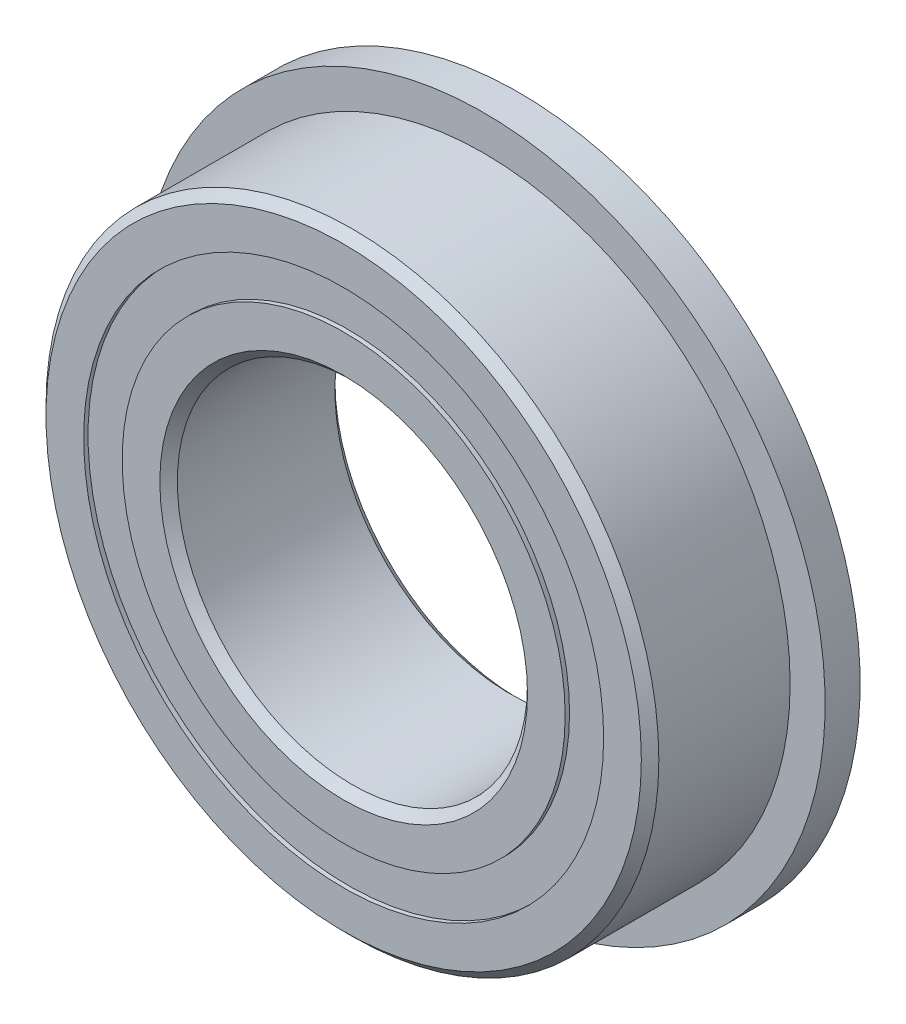
ISO-10303-21;
HEADER;
FILE_DESCRIPTION(('STEP AP214'),'2;1');
FILE_NAME('part.step','',(''),(''),'','','');
FILE_SCHEMA(('AUTOMOTIVE_DESIGN { 1 0 10303 214 1 1 1 1 }'));
ENDSEC;
DATA;
#1=APPLICATION_CONTEXT('core data for automotive mechanical design processes');
#2=APPLICATION_PROTOCOL_DEFINITION('international standard','automotive_design',2000,#1);
#3=PRODUCT_CONTEXT('',#1,'mechanical');
#4=PRODUCT('Part','Part','',(#3));
#5=PRODUCT_RELATED_PRODUCT_CATEGORY('part','',(#4));
#6=PRODUCT_DEFINITION_FORMATION('','',#4);
#7=PRODUCT_DEFINITION_CONTEXT('part definition',#1,'design');
#8=PRODUCT_DEFINITION('design','',#6,#7);
#9=PRODUCT_DEFINITION_SHAPE('','',#8);
#10=(LENGTH_UNIT() NAMED_UNIT(*) SI_UNIT(.MILLI.,.METRE.));
#11=(NAMED_UNIT(*) PLANE_ANGLE_UNIT() SI_UNIT($,.RADIAN.));
#12=(NAMED_UNIT(*) SI_UNIT($,.STERADIAN.) SOLID_ANGLE_UNIT());
#13=UNCERTAINTY_MEASURE_WITH_UNIT(LENGTH_MEASURE(1.E-05),#10,'distance_accuracy_value','');
#14=(GEOMETRIC_REPRESENTATION_CONTEXT(3) GLOBAL_UNCERTAINTY_ASSIGNED_CONTEXT((#13)) GLOBAL_UNIT_ASSIGNED_CONTEXT((#10,
#11,#12)) REPRESENTATION_CONTEXT('',''));
#15=CARTESIAN_POINT('',(0.,0.,0.));
#16=DIRECTION('',(0.,0.,1.));
#17=DIRECTION('',(1.,0.,0.));
#18=AXIS2_PLACEMENT_3D('',#15,#16,#17);
#19=CARTESIAN_POINT('',(0.,5.93956043956044,-1.9));
#20=DIRECTION('',(0.,0.,1.));
#21=DIRECTION('',(1.,0.,0.));
#22=AXIS2_PLACEMENT_3D('',#19,#20,#21);
#23=PLANE('',#22);
#24=CARTESIAN_POINT('',(0.,0.,-1.9));
#25=DIRECTION('',(0.,0.,1.));
#26=DIRECTION('',(1.,0.,0.));
#27=AXIS2_PLACEMENT_3D('',#24,#25,#26);
#28=CIRCLE('',#27,5.93956043956044);
#29=CARTESIAN_POINT('',(5.93956043956044,0.,-1.9));
#30=VERTEX_POINT('',#29);
#31=EDGE_CURVE('E56',#30,#30,#28,.T.);
#32=ORIENTED_EDGE('',*,*,#31,.F.);
#33=EDGE_LOOP('',(#32));
#34=FACE_BOUND('',#33,.T.);
#35=CARTESIAN_POINT('',(0.,0.,-1.9));
#36=DIRECTION('',(0.,0.,1.));
#37=DIRECTION('',(1.,0.,0.));
#38=AXIS2_PLACEMENT_3D('',#35,#36,#37);
#39=CIRCLE('',#38,5.06043956043956);
#40=CARTESIAN_POINT('',(5.06043956043956,0.,-1.9));
#41=VERTEX_POINT('',#40);
#42=EDGE_CURVE('E11',#41,#41,#39,.T.);
#43=ORIENTED_EDGE('',*,*,#42,.T.);
#44=EDGE_LOOP('',(#43));
#45=FACE_BOUND('',#44,.T.);
#46=ADVANCED_FACE('F42',(#34,#45),#23,.F.);
#47=CARTESIAN_POINT('',(0.,0.,2.));
#48=DIRECTION('',(0.,0.,1.));
#49=DIRECTION('',(1.,0.,0.));
#50=AXIS2_PLACEMENT_3D('',#47,#48,#49);
#51=CYLINDRICAL_SURFACE('',#50,5.06043956043956);
#52=ORIENTED_EDGE('',*,*,#42,.F.);
#53=EDGE_LOOP('',(#52));
#54=FACE_BOUND('',#53,.T.);
#55=CARTESIAN_POINT('',(0.,0.,-0.991633418565898));
#56=DIRECTION('',(0.,0.,1.));
#57=DIRECTION('',(1.,0.,0.));
#58=AXIS2_PLACEMENT_3D('',#55,#56,#57);
#59=CIRCLE('',#58,5.06043956043956);
#60=CARTESIAN_POINT('',(5.06043956043956,0.,-0.991633418565898));
#61=VERTEX_POINT('',#60);
#62=EDGE_CURVE('E48',#61,#61,#59,.T.);
#63=ORIENTED_EDGE('',*,*,#62,.T.);
#64=EDGE_LOOP('',(#63));
#65=FACE_BOUND('',#64,.T.);
#66=ADVANCED_FACE('F65',(#54,#65),#51,.F.);
#67=CARTESIAN_POINT('',(0.,5.93956043956044,-0.991633418565898));
#68=DIRECTION('',(0.,0.,-1.));
#69=DIRECTION('',(-1.,0.,0.));
#70=AXIS2_PLACEMENT_3D('',#67,#68,#69);
#71=PLANE('',#70);
#72=ORIENTED_EDGE('',*,*,#62,.F.);
#73=EDGE_LOOP('',(#72));
#74=FACE_BOUND('',#73,.T.);
#75=CARTESIAN_POINT('',(0.,0.,-0.991633418565898));
#76=DIRECTION('',(0.,0.,1.));
#77=DIRECTION('',(1.,0.,0.));
#78=AXIS2_PLACEMENT_3D('',#75,#76,#77);
#79=CIRCLE('',#78,5.93956043956044);
#80=CARTESIAN_POINT('',(5.93956043956044,0.,-0.991633418565898));
#81=VERTEX_POINT('',#80);
#82=EDGE_CURVE('E52',#81,#81,#79,.T.);
#83=ORIENTED_EDGE('',*,*,#82,.T.);
#84=EDGE_LOOP('',(#83));
#85=FACE_BOUND('',#84,.T.);
#86=ADVANCED_FACE('F69',(#74,#85),#71,.F.);
#87=CARTESIAN_POINT('',(0.,0.,2.));
#88=DIRECTION('',(0.,0.,1.));
#89=DIRECTION('',(1.,0.,0.));
#90=AXIS2_PLACEMENT_3D('',#87,#88,#89);
#91=CYLINDRICAL_SURFACE('',#90,5.93956043956044);
#92=ORIENTED_EDGE('',*,*,#82,.F.);
#93=EDGE_LOOP('',(#92));
#94=FACE_BOUND('',#93,.T.);
#95=ORIENTED_EDGE('',*,*,#31,.T.);
#96=EDGE_LOOP('',(#95));
#97=FACE_BOUND('',#96,.T.);
#98=ADVANCED_FACE('F62',(#94,#97),#91,.T.);
#99=CLOSED_SHELL('',(#46,#66,#86,#98));
#100=MANIFOLD_SOLID_BREP('B2',#99);
#101=CARTESIAN_POINT('',(0.,5.93956043956044,1.9));
#102=DIRECTION('',(0.,0.,-1.));
#103=DIRECTION('',(-1.,0.,0.));
#104=AXIS2_PLACEMENT_3D('',#101,#102,#103);
#105=PLANE('',#104);
#106=CARTESIAN_POINT('',(0.,0.,1.9));
#107=DIRECTION('',(0.,0.,1.));
#108=DIRECTION('',(1.,0.,0.));
#109=AXIS2_PLACEMENT_3D('',#106,#107,#108);
#110=CIRCLE('',#109,5.06043956043956);
#111=CARTESIAN_POINT('',(5.06043956043956,0.,1.9));
#112=VERTEX_POINT('',#111);
#113=EDGE_CURVE('E41',#112,#112,#110,.T.);
#114=ORIENTED_EDGE('',*,*,#113,.F.);
#115=EDGE_LOOP('',(#114));
#116=FACE_BOUND('',#115,.T.);
#117=CARTESIAN_POINT('',(0.,0.,1.9));
#118=DIRECTION('',(0.,0.,1.));
#119=DIRECTION('',(1.,0.,0.));
#120=AXIS2_PLACEMENT_3D('',#117,#118,#119);
#121=CIRCLE('',#120,5.93956043956044);
#122=CARTESIAN_POINT('',(5.93956043956044,0.,1.9));
#123=VERTEX_POINT('',#122);
#124=EDGE_CURVE('E124',#123,#123,#121,.T.);
#125=ORIENTED_EDGE('',*,*,#124,.T.);
#126=EDGE_LOOP('',(#125));
#127=FACE_BOUND('',#126,.T.);
#128=ADVANCED_FACE('F110',(#116,#127),#105,.F.);
#129=CARTESIAN_POINT('',(0.,0.,2.));
#130=DIRECTION('',(0.,0.,1.));
#131=DIRECTION('',(1.,0.,0.));
#132=AXIS2_PLACEMENT_3D('',#129,#130,#131);
#133=CYLINDRICAL_SURFACE('',#132,5.06043956043956);
#134=CARTESIAN_POINT('',(0.,0.,0.991633418565898));
#135=DIRECTION('',(0.,0.,1.));
#136=DIRECTION('',(1.,0.,0.));
#137=AXIS2_PLACEMENT_3D('',#134,#135,#136);
#138=CIRCLE('',#137,5.06043956043956);
#139=CARTESIAN_POINT('',(5.06043956043956,0.,0.991633418565898));
#140=VERTEX_POINT('',#139);
#141=EDGE_CURVE('E116',#140,#140,#138,.T.);
#142=ORIENTED_EDGE('',*,*,#141,.F.);
#143=EDGE_LOOP('',(#142));
#144=FACE_BOUND('',#143,.T.);
#145=ORIENTED_EDGE('',*,*,#113,.T.);
#146=EDGE_LOOP('',(#145));
#147=FACE_BOUND('',#146,.T.);
#148=ADVANCED_FACE('F139',(#144,#147),#133,.F.);
#149=CARTESIAN_POINT('',(0.,5.93956043956044,0.991633418565898));
#150=DIRECTION('',(0.,0.,1.));
#151=DIRECTION('',(1.,0.,0.));
#152=AXIS2_PLACEMENT_3D('',#149,#150,#151);
#153=PLANE('',#152);
#154=CARTESIAN_POINT('',(0.,0.,0.991633418565898));
#155=DIRECTION('',(0.,0.,1.));
#156=DIRECTION('',(1.,0.,0.));
#157=AXIS2_PLACEMENT_3D('',#154,#155,#156);
#158=CIRCLE('',#157,5.93956043956044);
#159=CARTESIAN_POINT('',(5.93956043956044,0.,0.991633418565898));
#160=VERTEX_POINT('',#159);
#161=EDGE_CURVE('E120',#160,#160,#158,.T.);
#162=ORIENTED_EDGE('',*,*,#161,.F.);
#163=EDGE_LOOP('',(#162));
#164=FACE_BOUND('',#163,.T.);
#165=ORIENTED_EDGE('',*,*,#141,.T.);
#166=EDGE_LOOP('',(#165));
#167=FACE_BOUND('',#166,.T.);
#168=ADVANCED_FACE('F134',(#164,#167),#153,.F.);
#169=CARTESIAN_POINT('',(0.,0.,2.));
#170=DIRECTION('',(0.,0.,1.));
#171=DIRECTION('',(1.,0.,0.));
#172=AXIS2_PLACEMENT_3D('',#169,#170,#171);
#173=CYLINDRICAL_SURFACE('',#172,5.93956043956044);
#174=ORIENTED_EDGE('',*,*,#124,.F.);
#175=EDGE_LOOP('',(#174));
#176=FACE_BOUND('',#175,.T.);
#177=ORIENTED_EDGE('',*,*,#161,.T.);
#178=EDGE_LOOP('',(#177));
#179=FACE_BOUND('',#178,.T.);
#180=ADVANCED_FACE('F131',(#176,#179),#173,.T.);
#181=CLOSED_SHELL('',(#128,#148,#168,#180));
#182=MANIFOLD_SOLID_BREP('B6',#181);
#183=CARTESIAN_POINT('',(-2.74999999999994,4.76313972081445,0.));
#184=DIRECTION('',(0.,0.,1.));
#185=DIRECTION('',(-0.499999999999989,0.866025403784445,0.));
#186=AXIS2_PLACEMENT_3D('',#183,#184,#185);
#187=SPHERICAL_SURFACE('',#186,0.991633418565898);
#188=CARTESIAN_POINT('',(-2.74999999999994,4.76313972081445,0.991633418565898));
#189=VERTEX_POINT('',#188);
#190=VERTEX_LOOP('',#189);
#191=FACE_BOUND('',#190,.T.);
#192=ADVANCED_FACE('F177',(#191),#187,.T.);
#193=CLOSED_SHELL('',(#192));
#194=MANIFOLD_SOLID_BREP('B36',#193);
#195=CARTESIAN_POINT('',(-4.76313972081438,2.75000000000006,0.));
#196=DIRECTION('',(0.,0.,1.));
#197=DIRECTION('',(-0.866025403784433,0.50000000000001,0.));
#198=AXIS2_PLACEMENT_3D('',#195,#196,#197);
#199=SPHERICAL_SURFACE('',#198,0.991633418565898);
#200=CARTESIAN_POINT('',(-4.76313972081438,2.75000000000006,0.991633418565898));
#201=VERTEX_POINT('',#200);
#202=VERTEX_LOOP('',#201);
#203=FACE_BOUND('',#202,.T.);
#204=ADVANCED_FACE('F197',(#203),#199,.T.);
#205=CLOSED_SHELL('',(#204));
#206=MANIFOLD_SOLID_BREP('B106',#205);
#207=CARTESIAN_POINT('',(-5.5,0.,0.));
#208=DIRECTION('',(0.,0.,1.));
#209=DIRECTION('',(-1.,0.,0.));
#210=AXIS2_PLACEMENT_3D('',#207,#208,#209);
#211=SPHERICAL_SURFACE('',#210,0.991633418565898);
#212=CARTESIAN_POINT('',(-5.5,0.,0.991633418565898));
#213=VERTEX_POINT('',#212);
#214=VERTEX_LOOP('',#213);
#215=FACE_BOUND('',#214,.T.);
#216=ADVANCED_FACE('F217',(#215),#211,.T.);
#217=CLOSED_SHELL('',(#216));
#218=MANIFOLD_SOLID_BREP('B173',#217);
#219=CARTESIAN_POINT('',(-4.76313972081444,-2.74999999999996,0.));
#220=DIRECTION('',(0.,0.,1.));
#221=DIRECTION('',(-0.866025403784443,-0.499999999999992,0.));
#222=AXIS2_PLACEMENT_3D('',#219,#220,#221);
#223=SPHERICAL_SURFACE('',#222,0.991633418565898);
#224=CARTESIAN_POINT('',(-4.76313972081444,-2.74999999999996,0.991633418565898));
#225=VERTEX_POINT('',#224);
#226=VERTEX_LOOP('',#225);
#227=FACE_BOUND('',#226,.T.);
#228=ADVANCED_FACE('F237',(#227),#223,.T.);
#229=CLOSED_SHELL('',(#228));
#230=MANIFOLD_SOLID_BREP('B193',#229);
#231=CARTESIAN_POINT('',(-2.75000000000004,-4.76313972081439,0.));
#232=DIRECTION('',(0.,0.,1.));
#233=DIRECTION('',(-0.500000000000007,-0.866025403784435,0.));
#234=AXIS2_PLACEMENT_3D('',#231,#232,#233);
#235=SPHERICAL_SURFACE('',#234,0.991633418565898);
#236=CARTESIAN_POINT('',(-2.75000000000004,-4.76313972081439,0.991633418565898));
#237=VERTEX_POINT('',#236);
#238=VERTEX_LOOP('',#237);
#239=FACE_BOUND('',#238,.T.);
#240=ADVANCED_FACE('F257',(#239),#235,.T.);
#241=CLOSED_SHELL('',(#240));
#242=MANIFOLD_SOLID_BREP('B213',#241);
#243=CARTESIAN_POINT('',(0.,-5.5,0.));
#244=DIRECTION('',(0.,0.,1.));
#245=DIRECTION('',(0.,-1.,0.));
#246=AXIS2_PLACEMENT_3D('',#243,#244,#245);
#247=SPHERICAL_SURFACE('',#246,0.991633418565898);
#248=CARTESIAN_POINT('',(0.,-5.5,0.991633418565898));
#249=VERTEX_POINT('',#248);
#250=VERTEX_LOOP('',#249);
#251=FACE_BOUND('',#250,.T.);
#252=ADVANCED_FACE('F277',(#251),#247,.T.);
#253=CLOSED_SHELL('',(#252));
#254=MANIFOLD_SOLID_BREP('B233',#253);
#255=CARTESIAN_POINT('',(2.74999999999997,-4.76313972081443,0.));
#256=DIRECTION('',(0.,0.,1.));
#257=DIRECTION('',(0.499999999999995,-0.866025403784442,0.));
#258=AXIS2_PLACEMENT_3D('',#255,#256,#257);
#259=SPHERICAL_SURFACE('',#258,0.991633418565898);
#260=CARTESIAN_POINT('',(2.74999999999997,-4.76313972081443,0.991633418565898));
#261=VERTEX_POINT('',#260);
#262=VERTEX_LOOP('',#261);
#263=FACE_BOUND('',#262,.T.);
#264=ADVANCED_FACE('F297',(#263),#259,.T.);
#265=CLOSED_SHELL('',(#264));
#266=MANIFOLD_SOLID_BREP('B253',#265);
#267=CARTESIAN_POINT('',(4.7631397208144,-2.75000000000002,0.));
#268=DIRECTION('',(0.,0.,1.));
#269=DIRECTION('',(0.866025403784436,-0.500000000000004,0.));
#270=AXIS2_PLACEMENT_3D('',#267,#268,#269);
#271=SPHERICAL_SURFACE('',#270,0.991633418565898);
#272=CARTESIAN_POINT('',(4.7631397208144,-2.75000000000002,0.991633418565898));
#273=VERTEX_POINT('',#272);
#274=VERTEX_LOOP('',#273);
#275=FACE_BOUND('',#274,.T.);
#276=ADVANCED_FACE('F317',(#275),#271,.T.);
#277=CLOSED_SHELL('',(#276));
#278=MANIFOLD_SOLID_BREP('B273',#277);
#279=CARTESIAN_POINT('',(5.5,0.,0.));
#280=DIRECTION('',(0.,0.,1.));
#281=DIRECTION('',(1.,0.,0.));
#282=AXIS2_PLACEMENT_3D('',#279,#280,#281);
#283=SPHERICAL_SURFACE('',#282,0.991633418565898);
#284=CARTESIAN_POINT('',(5.5,0.,0.991633418565898));
#285=VERTEX_POINT('',#284);
#286=VERTEX_LOOP('',#285);
#287=FACE_BOUND('',#286,.T.);
#288=ADVANCED_FACE('F337',(#287),#283,.T.);
#289=CLOSED_SHELL('',(#288));
#290=MANIFOLD_SOLID_BREP('B293',#289);
#291=CARTESIAN_POINT('',(4.76313972081442,2.74999999999999,0.));
#292=DIRECTION('',(0.,0.,1.));
#293=DIRECTION('',(0.86602540378444,0.499999999999998,0.));
#294=AXIS2_PLACEMENT_3D('',#291,#292,#293);
#295=SPHERICAL_SURFACE('',#294,0.991633418565898);
#296=CARTESIAN_POINT('',(4.76313972081442,2.74999999999999,0.991633418565898));
#297=VERTEX_POINT('',#296);
#298=VERTEX_LOOP('',#297);
#299=FACE_BOUND('',#298,.T.);
#300=ADVANCED_FACE('F357',(#299),#295,.T.);
#301=CLOSED_SHELL('',(#300));
#302=MANIFOLD_SOLID_BREP('B313',#301);
#303=CARTESIAN_POINT('',(2.75000000000001,4.76313972081441,0.));
#304=DIRECTION('',(0.,0.,1.));
#305=DIRECTION('',(0.500000000000001,0.866025403784438,0.));
#306=AXIS2_PLACEMENT_3D('',#303,#304,#305);
#307=SPHERICAL_SURFACE('',#306,0.991633418565898);
#308=CARTESIAN_POINT('',(2.75000000000001,4.76313972081441,0.991633418565898));
#309=VERTEX_POINT('',#308);
#310=VERTEX_LOOP('',#309);
#311=FACE_BOUND('',#310,.T.);
#312=ADVANCED_FACE('F377',(#311),#307,.T.);
#313=CLOSED_SHELL('',(#312));
#314=MANIFOLD_SOLID_BREP('B333',#313);
#315=CARTESIAN_POINT('',(0.,5.5,0.));
#316=DIRECTION('',(0.,0.,1.));
#317=DIRECTION('',(0.,1.,0.));
#318=AXIS2_PLACEMENT_3D('',#315,#316,#317);
#319=SPHERICAL_SURFACE('',#318,0.991633418565898);
#320=CARTESIAN_POINT('',(0.,5.5,0.991633418565898));
#321=VERTEX_POINT('',#320);
#322=VERTEX_LOOP('',#321);
#323=FACE_BOUND('',#322,.T.);
#324=ADVANCED_FACE('F400',(#323),#319,.T.);
#325=CLOSED_SHELL('',(#324));
#326=MANIFOLD_SOLID_BREP('B353',#325);
#327=CARTESIAN_POINT('',(0.,5.06043956043956,2.));
#328=DIRECTION('',(0.,0.,-1.));
#329=DIRECTION('',(-1.,0.,0.));
#330=AXIS2_PLACEMENT_3D('',#327,#328,#329);
#331=PLANE('',#330);
#332=CARTESIAN_POINT('',(0.,0.,2.));
#333=DIRECTION('',(0.,0.,1.));
#334=DIRECTION('',(1.,0.,0.));
#335=AXIS2_PLACEMENT_3D('',#332,#333,#334);
#336=CIRCLE('',#335,4.2);
#337=CARTESIAN_POINT('',(4.2,0.,2.));
#338=VERTEX_POINT('',#337);
#339=EDGE_CURVE('E448',#338,#338,#336,.T.);
#340=ORIENTED_EDGE('',*,*,#339,.F.);
#341=EDGE_LOOP('',(#340));
#342=FACE_BOUND('',#341,.T.);
#343=CARTESIAN_POINT('',(0.,0.,2.));
#344=DIRECTION('',(0.,0.,1.));
#345=DIRECTION('',(1.,0.,0.));
#346=AXIS2_PLACEMENT_3D('',#343,#344,#345);
#347=CIRCLE('',#346,5.06043956043956);
#348=CARTESIAN_POINT('',(5.06043956043956,0.,2.));
#349=VERTEX_POINT('',#348);
#350=EDGE_CURVE('E399',#349,#349,#347,.T.);
#351=ORIENTED_EDGE('',*,*,#350,.T.);
#352=EDGE_LOOP('',(#351));
#353=FACE_BOUND('',#352,.T.);
#354=ADVANCED_FACE('F420',(#342,#353),#331,.F.);
#355=CARTESIAN_POINT('',(0.,0.,2.));
#356=DIRECTION('',(0.,0.,1.));
#357=DIRECTION('',(1.,0.,0.));
#358=AXIS2_PLACEMENT_3D('',#355,#356,#357);
#359=CYLINDRICAL_SURFACE('',#358,5.06043956043956);
#360=ORIENTED_EDGE('',*,*,#350,.F.);
#361=EDGE_LOOP('',(#360));
#362=FACE_BOUND('',#361,.T.);
#363=CARTESIAN_POINT('',(0.,0.,0.888888888888889));
#364=DIRECTION('',(0.,0.,1.));
#365=DIRECTION('',(1.,0.,0.));
#366=AXIS2_PLACEMENT_3D('',#363,#364,#365);
#367=CIRCLE('',#366,5.06043956043956);
#368=CARTESIAN_POINT('',(5.06043956043956,0.,0.888888888888889));
#369=VERTEX_POINT('',#368);
#370=EDGE_CURVE('E426',#369,#369,#367,.T.);
#371=ORIENTED_EDGE('',*,*,#370,.T.);
#372=EDGE_LOOP('',(#371));
#373=FACE_BOUND('',#372,.T.);
#374=ADVANCED_FACE('F455',(#362,#373),#359,.T.);
#375=CARTESIAN_POINT('',(0.,0.,0.));
#376=DIRECTION('',(0.,0.,1.));
#377=DIRECTION('',(1.,0.,0.));
#378=AXIS2_PLACEMENT_3D('',#375,#376,#377);
#379=TOROIDAL_SURFACE('',#378,5.5,0.991633418565897);
#380=ORIENTED_EDGE('',*,*,#370,.F.);
#381=EDGE_LOOP('',(#380));
#382=FACE_BOUND('',#381,.T.);
#383=CARTESIAN_POINT('',(0.,0.,-0.88888888888889));
#384=DIRECTION('',(0.,0.,1.));
#385=DIRECTION('',(1.,0.,0.));
#386=AXIS2_PLACEMENT_3D('',#383,#384,#385);
#387=CIRCLE('',#386,5.06043956043956);
#388=CARTESIAN_POINT('',(5.06043956043956,0.,-0.88888888888889));
#389=VERTEX_POINT('',#388);
#390=EDGE_CURVE('E430',#389,#389,#387,.T.);
#391=ORIENTED_EDGE('',*,*,#390,.T.);
#392=EDGE_LOOP('',(#391));
#393=FACE_BOUND('',#392,.T.);
#394=ADVANCED_FACE('F459',(#382,#393),#379,.F.);
#395=CARTESIAN_POINT('',(0.,0.,2.));
#396=DIRECTION('',(0.,0.,1.));
#397=DIRECTION('',(1.,0.,0.));
#398=AXIS2_PLACEMENT_3D('',#395,#396,#397);
#399=CYLINDRICAL_SURFACE('',#398,5.06043956043956);
#400=ORIENTED_EDGE('',*,*,#390,.F.);
#401=EDGE_LOOP('',(#400));
#402=FACE_BOUND('',#401,.T.);
#403=CARTESIAN_POINT('',(0.,0.,-2.));
#404=DIRECTION('',(0.,0.,1.));
#405=DIRECTION('',(1.,0.,0.));
#406=AXIS2_PLACEMENT_3D('',#403,#404,#405);
#407=CIRCLE('',#406,5.06043956043956);
#408=CARTESIAN_POINT('',(5.06043956043956,0.,-2.));
#409=VERTEX_POINT('',#408);
#410=EDGE_CURVE('E434',#409,#409,#407,.T.);
#411=ORIENTED_EDGE('',*,*,#410,.T.);
#412=EDGE_LOOP('',(#411));
#413=FACE_BOUND('',#412,.T.);
#414=ADVANCED_FACE('F464',(#402,#413),#399,.T.);
#415=CARTESIAN_POINT('',(0.,4.2,-2.));
#416=DIRECTION('',(0.,0.,1.));
#417=DIRECTION('',(1.,0.,0.));
#418=AXIS2_PLACEMENT_3D('',#415,#416,#417);
#419=PLANE('',#418);
#420=ORIENTED_EDGE('',*,*,#410,.F.);
#421=EDGE_LOOP('',(#420));
#422=FACE_BOUND('',#421,.T.);
#423=CARTESIAN_POINT('',(0.,0.,-2.));
#424=DIRECTION('',(0.,0.,1.));
#425=DIRECTION('',(1.,0.,0.));
#426=AXIS2_PLACEMENT_3D('',#423,#424,#425);
#427=CIRCLE('',#426,4.2);
#428=CARTESIAN_POINT('',(4.2,0.,-2.));
#429=VERTEX_POINT('',#428);
#430=EDGE_CURVE('E439',#429,#429,#427,.T.);
#431=ORIENTED_EDGE('',*,*,#430,.T.);
#432=EDGE_LOOP('',(#431));
#433=FACE_BOUND('',#432,.T.);
#434=ADVANCED_FACE('F470',(#422,#433),#419,.F.);
#435=CARTESIAN_POINT('',(0.,0.,-1.8));
#436=DIRECTION('',(0.,0.,-1.));
#437=DIRECTION('',(-1.,0.,0.));
#438=AXIS2_PLACEMENT_3D('',#435,#436,#437);
#439=CONICAL_SURFACE('',#438,4.,0.78539816339745);
#440=ORIENTED_EDGE('',*,*,#430,.F.);
#441=EDGE_LOOP('',(#440));
#442=FACE_BOUND('',#441,.T.);
#443=CARTESIAN_POINT('',(0.,0.,-1.8));
#444=DIRECTION('',(0.,0.,1.));
#445=DIRECTION('',(1.,0.,0.));
#446=AXIS2_PLACEMENT_3D('',#443,#444,#445);
#447=CIRCLE('',#446,4.);
#448=CARTESIAN_POINT('',(4.,0.,-1.8));
#449=VERTEX_POINT('',#448);
#450=EDGE_CURVE('E442',#449,#449,#447,.T.);
#451=ORIENTED_EDGE('',*,*,#450,.T.);
#452=EDGE_LOOP('',(#451));
#453=FACE_BOUND('',#452,.T.);
#454=ADVANCED_FACE('F474',(#442,#453),#439,.F.);
#455=CARTESIAN_POINT('',(0.,0.,2.));
#456=DIRECTION('',(0.,0.,1.));
#457=DIRECTION('',(1.,0.,0.));
#458=AXIS2_PLACEMENT_3D('',#455,#456,#457);
#459=CYLINDRICAL_SURFACE('',#458,4.);
#460=ORIENTED_EDGE('',*,*,#450,.F.);
#461=EDGE_LOOP('',(#460));
#462=FACE_BOUND('',#461,.T.);
#463=CARTESIAN_POINT('',(0.,0.,1.8));
#464=DIRECTION('',(0.,0.,1.));
#465=DIRECTION('',(1.,0.,0.));
#466=AXIS2_PLACEMENT_3D('',#463,#464,#465);
#467=CIRCLE('',#466,4.);
#468=CARTESIAN_POINT('',(4.,0.,1.8));
#469=VERTEX_POINT('',#468);
#470=EDGE_CURVE('E445',#469,#469,#467,.T.);
#471=ORIENTED_EDGE('',*,*,#470,.T.);
#472=EDGE_LOOP('',(#471));
#473=FACE_BOUND('',#472,.T.);
#474=ADVANCED_FACE('F478',(#462,#473),#459,.F.);
#475=CARTESIAN_POINT('',(0.,0.,2.));
#476=DIRECTION('',(0.,0.,1.));
#477=DIRECTION('',(1.,0.,0.));
#478=AXIS2_PLACEMENT_3D('',#475,#476,#477);
#479=CONICAL_SURFACE('',#478,4.2,0.785398163397446);
#480=ORIENTED_EDGE('',*,*,#470,.F.);
#481=EDGE_LOOP('',(#480));
#482=FACE_BOUND('',#481,.T.);
#483=ORIENTED_EDGE('',*,*,#339,.T.);
#484=EDGE_LOOP('',(#483));
#485=FACE_BOUND('',#484,.T.);
#486=ADVANCED_FACE('F452',(#482,#485),#479,.F.);
#487=CLOSED_SHELL('',(#354,#374,#394,#414,#434,#454,#474,#486));
#488=MANIFOLD_SOLID_BREP('B373',#487);
#489=CARTESIAN_POINT('',(0.,0.,1.8));
#490=DIRECTION('',(0.,0.,-1.));
#491=DIRECTION('',(-1.,0.,0.));
#492=AXIS2_PLACEMENT_3D('',#489,#490,#491);
#493=CONICAL_SURFACE('',#492,7.,0.785398163397449);
#494=CARTESIAN_POINT('',(0.,0.,2.));
#495=DIRECTION('',(0.,0.,1.));
#496=DIRECTION('',(1.,0.,0.));
#497=AXIS2_PLACEMENT_3D('',#494,#495,#496);
#498=CIRCLE('',#497,6.8);
#499=CARTESIAN_POINT('',(6.8,0.,2.));
#500=VERTEX_POINT('',#499);
#501=EDGE_CURVE('E564',#500,#500,#498,.T.);
#502=ORIENTED_EDGE('',*,*,#501,.F.);
#503=EDGE_LOOP('',(#502));
#504=FACE_BOUND('',#503,.T.);
#505=CARTESIAN_POINT('',(0.,0.,1.8));
#506=DIRECTION('',(0.,0.,1.));
#507=DIRECTION('',(1.,0.,0.));
#508=AXIS2_PLACEMENT_3D('',#505,#506,#507);
#509=CIRCLE('',#508,7.);
#510=CARTESIAN_POINT('',(7.,0.,1.8));
#511=VERTEX_POINT('',#510);
#512=EDGE_CURVE('E419',#511,#511,#509,.T.);
#513=ORIENTED_EDGE('',*,*,#512,.T.);
#514=EDGE_LOOP('',(#513));
#515=FACE_BOUND('',#514,.T.);
#516=ADVANCED_FACE('F542',(#504,#515),#493,.T.);
#517=CARTESIAN_POINT('',(0.,0.,2.));
#518=DIRECTION('',(0.,0.,1.));
#519=DIRECTION('',(1.,0.,0.));
#520=AXIS2_PLACEMENT_3D('',#517,#518,#519);
#521=CYLINDRICAL_SURFACE('',#520,7.);
#522=CARTESIAN_POINT('',(0.,0.,-1.2));
#523=DIRECTION('',(0.,0.,1.));
#524=DIRECTION('',(1.,0.,0.));
#525=AXIS2_PLACEMENT_3D('',#522,#523,#524);
#526=CIRCLE('',#525,7.);
#527=CARTESIAN_POINT('',(7.,0.,-1.2));
#528=VERTEX_POINT('',#527);
#529=EDGE_CURVE('E567',#528,#528,#526,.T.);
#530=ORIENTED_EDGE('',*,*,#529,.T.);
#531=EDGE_LOOP('',(#530));
#532=FACE_BOUND('',#531,.T.);
#533=ORIENTED_EDGE('',*,*,#512,.F.);
#534=EDGE_LOOP('',(#533));
#535=FACE_BOUND('',#534,.T.);
#536=ADVANCED_FACE('F587',(#532,#535),#521,.T.);
#537=CARTESIAN_POINT('',(0.,6.8,-2.));
#538=DIRECTION('',(0.,0.,1.));
#539=DIRECTION('',(1.,0.,0.));
#540=AXIS2_PLACEMENT_3D('',#537,#538,#539);
#541=PLANE('',#540);
#542=CARTESIAN_POINT('',(0.,0.,-2.));
#543=DIRECTION('',(0.,0.,1.));
#544=DIRECTION('',(1.,0.,0.));
#545=AXIS2_PLACEMENT_3D('',#542,#543,#544);
#546=CIRCLE('',#545,5.93956043956044);
#547=CARTESIAN_POINT('',(5.93956043956044,0.,-2.));
#548=VERTEX_POINT('',#547);
#549=EDGE_CURVE('E548',#548,#548,#546,.T.);
#550=ORIENTED_EDGE('',*,*,#549,.T.);
#551=EDGE_LOOP('',(#550));
#552=FACE_BOUND('',#551,.T.);
#553=CARTESIAN_POINT('',(0.,0.,-2.));
#554=DIRECTION('',(0.,0.,-1.));
#555=DIRECTION('',(-1.,0.,0.));
#556=AXIS2_PLACEMENT_3D('',#553,#554,#555);
#557=CIRCLE('',#556,7.8);
#558=CARTESIAN_POINT('',(-7.8,0.,-2.));
#559=VERTEX_POINT('',#558);
#560=EDGE_CURVE('E570',#559,#559,#557,.T.);
#561=ORIENTED_EDGE('',*,*,#560,.T.);
#562=EDGE_LOOP('',(#561));
#563=FACE_BOUND('',#562,.T.);
#564=ADVANCED_FACE('F590',(#552,#563),#541,.F.);
#565=CARTESIAN_POINT('',(0.,0.,2.));
#566=DIRECTION('',(0.,0.,1.));
#567=DIRECTION('',(1.,0.,0.));
#568=AXIS2_PLACEMENT_3D('',#565,#566,#567);
#569=CYLINDRICAL_SURFACE('',#568,5.93956043956044);
#570=CARTESIAN_POINT('',(0.,0.,-0.888888888888889));
#571=DIRECTION('',(0.,0.,1.));
#572=DIRECTION('',(1.,0.,0.));
#573=AXIS2_PLACEMENT_3D('',#570,#571,#572);
#574=CIRCLE('',#573,5.93956043956044);
#575=CARTESIAN_POINT('',(5.93956043956044,0.,-0.888888888888889));
#576=VERTEX_POINT('',#575);
#577=EDGE_CURVE('E552',#576,#576,#574,.T.);
#578=ORIENTED_EDGE('',*,*,#577,.T.);
#579=EDGE_LOOP('',(#578));
#580=FACE_BOUND('',#579,.T.);
#581=ORIENTED_EDGE('',*,*,#549,.F.);
#582=EDGE_LOOP('',(#581));
#583=FACE_BOUND('',#582,.T.);
#584=ADVANCED_FACE('F595',(#580,#583),#569,.F.);
#585=CARTESIAN_POINT('',(0.,0.,0.));
#586=DIRECTION('',(0.,0.,1.));
#587=DIRECTION('',(1.,0.,0.));
#588=AXIS2_PLACEMENT_3D('',#585,#586,#587);
#589=TOROIDAL_SURFACE('',#588,5.5,0.991633418565898);
#590=ORIENTED_EDGE('',*,*,#577,.F.);
#591=EDGE_LOOP('',(#590));
#592=FACE_BOUND('',#591,.T.);
#593=CARTESIAN_POINT('',(0.,0.,0.888888888888889));
#594=DIRECTION('',(0.,0.,1.));
#595=DIRECTION('',(1.,0.,0.));
#596=AXIS2_PLACEMENT_3D('',#593,#594,#595);
#597=CIRCLE('',#596,5.93956043956044);
#598=CARTESIAN_POINT('',(5.93956043956044,0.,0.888888888888889));
#599=VERTEX_POINT('',#598);
#600=EDGE_CURVE('E556',#599,#599,#597,.T.);
#601=ORIENTED_EDGE('',*,*,#600,.T.);
#602=EDGE_LOOP('',(#601));
#603=FACE_BOUND('',#602,.T.);
#604=ADVANCED_FACE('F601',(#592,#603),#589,.F.);
#605=CARTESIAN_POINT('',(0.,0.,2.));
#606=DIRECTION('',(0.,0.,1.));
#607=DIRECTION('',(1.,0.,0.));
#608=AXIS2_PLACEMENT_3D('',#605,#606,#607);
#609=CYLINDRICAL_SURFACE('',#608,5.93956043956044);
#610=ORIENTED_EDGE('',*,*,#600,.F.);
#611=EDGE_LOOP('',(#610));
#612=FACE_BOUND('',#611,.T.);
#613=CARTESIAN_POINT('',(0.,0.,2.));
#614=DIRECTION('',(0.,0.,1.));
#615=DIRECTION('',(1.,0.,0.));
#616=AXIS2_PLACEMENT_3D('',#613,#614,#615);
#617=CIRCLE('',#616,5.93956043956044);
#618=CARTESIAN_POINT('',(5.93956043956044,0.,2.));
#619=VERTEX_POINT('',#618);
#620=EDGE_CURVE('E561',#619,#619,#617,.T.);
#621=ORIENTED_EDGE('',*,*,#620,.T.);
#622=EDGE_LOOP('',(#621));
#623=FACE_BOUND('',#622,.T.);
#624=ADVANCED_FACE('F605',(#612,#623),#609,.F.);
#625=CARTESIAN_POINT('',(0.,6.8,2.));
#626=DIRECTION('',(0.,0.,-1.));
#627=DIRECTION('',(-1.,0.,0.));
#628=AXIS2_PLACEMENT_3D('',#625,#626,#627);
#629=PLANE('',#628);
#630=ORIENTED_EDGE('',*,*,#620,.F.);
#631=EDGE_LOOP('',(#630));
#632=FACE_BOUND('',#631,.T.);
#633=ORIENTED_EDGE('',*,*,#501,.T.);
#634=EDGE_LOOP('',(#633));
#635=FACE_BOUND('',#634,.T.);
#636=ADVANCED_FACE('F583',(#632,#635),#629,.F.);
#637=CARTESIAN_POINT('',(0.,5.93956043956044,-1.2));
#638=DIRECTION('',(0.,0.,1.));
#639=DIRECTION('',(1.,0.,0.));
#640=AXIS2_PLACEMENT_3D('',#637,#638,#639);
#641=PLANE('',#640);
#642=CARTESIAN_POINT('',(0.,0.,-1.2));
#643=DIRECTION('',(0.,0.,-1.));
#644=DIRECTION('',(-1.,0.,0.));
#645=AXIS2_PLACEMENT_3D('',#642,#643,#644);
#646=CIRCLE('',#645,7.8);
#647=CARTESIAN_POINT('',(-7.8,0.,-1.2));
#648=VERTEX_POINT('',#647);
#649=EDGE_CURVE('E573',#648,#648,#646,.T.);
#650=ORIENTED_EDGE('',*,*,#649,.F.);
#651=EDGE_LOOP('',(#650));
#652=FACE_BOUND('',#651,.T.);
#653=ORIENTED_EDGE('',*,*,#529,.F.);
#654=EDGE_LOOP('',(#653));
#655=FACE_BOUND('',#654,.T.);
#656=ADVANCED_FACE('F580',(#652,#655),#641,.T.);
#657=CARTESIAN_POINT('',(0.,0.,-2.));
#658=DIRECTION('',(0.,0.,-1.));
#659=DIRECTION('',(-1.,0.,0.));
#660=AXIS2_PLACEMENT_3D('',#657,#658,#659);
#661=CYLINDRICAL_SURFACE('',#660,7.8);
#662=ORIENTED_EDGE('',*,*,#649,.T.);
#663=EDGE_LOOP('',(#662));
#664=FACE_BOUND('',#663,.T.);
#665=ORIENTED_EDGE('',*,*,#560,.F.);
#666=EDGE_LOOP('',(#665));
#667=FACE_BOUND('',#666,.T.);
#668=ADVANCED_FACE('F577',(#664,#667),#661,.T.);
#669=CLOSED_SHELL('',(#516,#536,#564,#584,#604,#624,#636,#656,#668));
#670=MANIFOLD_SOLID_BREP('B394',#669);
#671=ADVANCED_BREP_SHAPE_REPRESENTATION('',(#18,#100,#182,#194,#206,#218,#230,#242,#254,#266,
#278,#290,#302,#314,#326,#488,#670),#14);
#672=SHAPE_DEFINITION_REPRESENTATION(#9,#671);
ENDSEC;
END-ISO-10303-21;
